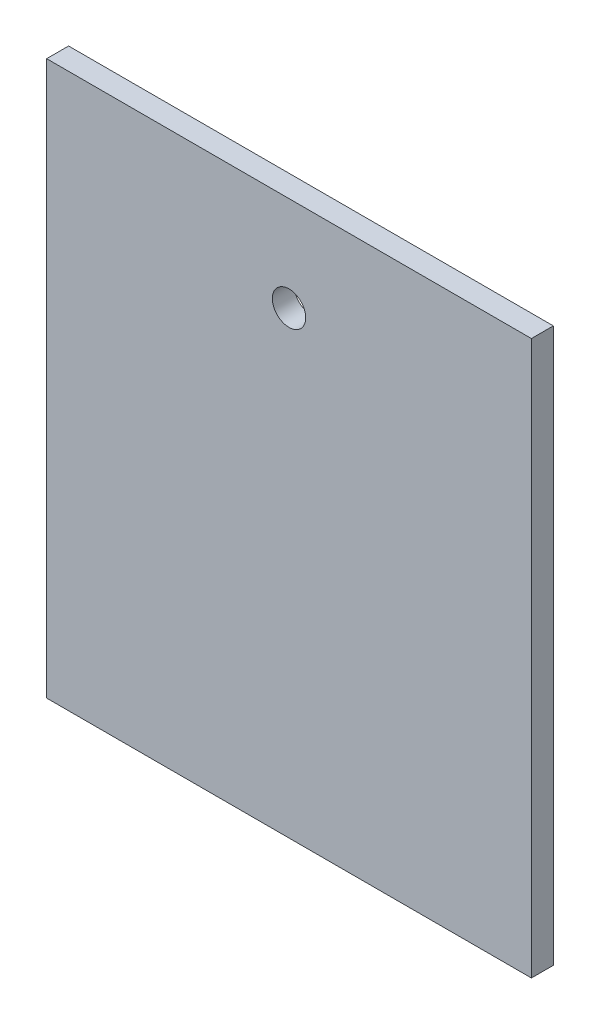
ISO-10303-21;
HEADER;
FILE_DESCRIPTION(('STEP AP214'),'2;1');
FILE_NAME('part.step','',(''),(''),'','','');
FILE_SCHEMA(('AUTOMOTIVE_DESIGN { 1 0 10303 214 1 1 1 1 }'));
ENDSEC;
DATA;
#1=APPLICATION_CONTEXT('core data for automotive mechanical design processes');
#2=APPLICATION_PROTOCOL_DEFINITION('international standard','automotive_design',2000,#1);
#3=PRODUCT_CONTEXT('',#1,'mechanical');
#4=PRODUCT('Part','Part','',(#3));
#5=PRODUCT_RELATED_PRODUCT_CATEGORY('part','',(#4));
#6=PRODUCT_DEFINITION_FORMATION('','',#4);
#7=PRODUCT_DEFINITION_CONTEXT('part definition',#1,'design');
#8=PRODUCT_DEFINITION('design','',#6,#7);
#9=PRODUCT_DEFINITION_SHAPE('','',#8);
#10=(LENGTH_UNIT() NAMED_UNIT(*) SI_UNIT(.MILLI.,.METRE.));
#11=(NAMED_UNIT(*) PLANE_ANGLE_UNIT() SI_UNIT($,.RADIAN.));
#12=(NAMED_UNIT(*) SI_UNIT($,.STERADIAN.) SOLID_ANGLE_UNIT());
#13=UNCERTAINTY_MEASURE_WITH_UNIT(LENGTH_MEASURE(1.E-05),#10,'distance_accuracy_value','');
#14=(GEOMETRIC_REPRESENTATION_CONTEXT(3) GLOBAL_UNCERTAINTY_ASSIGNED_CONTEXT((#13)) GLOBAL_UNIT_ASSIGNED_CONTEXT((#10,
#11,#12)) REPRESENTATION_CONTEXT('',''));
#15=CARTESIAN_POINT('',(0.,0.,0.));
#16=DIRECTION('',(0.,0.,1.));
#17=DIRECTION('',(1.,0.,0.));
#18=AXIS2_PLACEMENT_3D('',#15,#16,#17);
#19=CARTESIAN_POINT('',(0.,0.,3.175));
#20=DIRECTION('',(0.,0.,-1.));
#21=DIRECTION('',(-1.,0.,0.));
#22=AXIS2_PLACEMENT_3D('',#19,#20,#21);
#23=PLANE('',#22);
#24=DIRECTION('',(1.,0.,0.));
#25=VECTOR('',#24,1.);
#26=CARTESIAN_POINT('',(37.1356095053791,-0.0825578288975166,3.175));
#27=LINE('',#26,#25);
#28=CARTESIAN_POINT('',(-33.0335565021844,-0.0825578288975166,3.175));
#29=VERTEX_POINT('',#28);
#30=CARTESIAN_POINT('',(37.1356095053791,-0.0825578288975166,3.175));
#31=VERTEX_POINT('',#30);
#32=EDGE_CURVE('E86',#29,#31,#27,.T.);
#33=ORIENTED_EDGE('',*,*,#32,.T.);
#34=DIRECTION('',(0.,1.,0.));
#35=VECTOR('',#34,1.);
#36=CARTESIAN_POINT('',(37.1356095053791,80.0832933204729,3.175));
#37=LINE('',#36,#35);
#38=CARTESIAN_POINT('',(37.1356095053791,80.0832933204729,3.175));
#39=VERTEX_POINT('',#38);
#40=EDGE_CURVE('E81',#31,#39,#37,.T.);
#41=ORIENTED_EDGE('',*,*,#40,.T.);
#42=DIRECTION('',(-1.,0.,0.));
#43=VECTOR('',#42,1.);
#44=CARTESIAN_POINT('',(-33.0335565021844,80.0832933204729,3.175));
#45=LINE('',#44,#43);
#46=CARTESIAN_POINT('',(-33.0335565021844,80.0832933204729,3.175));
#47=VERTEX_POINT('',#46);
#48=EDGE_CURVE('E84',#39,#47,#45,.T.);
#49=ORIENTED_EDGE('',*,*,#48,.T.);
#50=DIRECTION('',(0.,-1.,0.));
#51=VECTOR('',#50,1.);
#52=CARTESIAN_POINT('',(-33.0335565021844,-0.0825578288975166,3.175));
#53=LINE('',#52,#51);
#54=EDGE_CURVE('E51',#47,#29,#53,.T.);
#55=ORIENTED_EDGE('',*,*,#54,.T.);
#56=EDGE_LOOP('',(#33,#41,#49,#55));
#57=FACE_BOUND('',#56,.T.);
#58=CARTESIAN_POINT('',(2.05020920502091,66.35,3.175));
#59=DIRECTION('',(0.,0.,1.));
#60=DIRECTION('',(1.,0.,0.));
#61=AXIS2_PLACEMENT_3D('',#58,#59,#60);
#62=CIRCLE('',#61,2.415);
#63=CARTESIAN_POINT('',(4.46520920502091,66.35,3.175));
#64=VERTEX_POINT('',#63);
#65=EDGE_CURVE('E101',#64,#64,#62,.T.);
#66=ORIENTED_EDGE('',*,*,#65,.F.);
#67=EDGE_LOOP('',(#66));
#68=FACE_BOUND('',#67,.T.);
#69=ADVANCED_FACE('F34',(#57,#68),#23,.F.);
#70=CARTESIAN_POINT('',(0.,0.,0.));
#71=DIRECTION('',(0.,0.,-1.));
#72=DIRECTION('',(-1.,0.,0.));
#73=AXIS2_PLACEMENT_3D('',#70,#71,#72);
#74=PLANE('',#73);
#75=DIRECTION('',(1.,0.,0.));
#76=VECTOR('',#75,1.);
#77=CARTESIAN_POINT('',(37.1356095053791,-0.0825578288975166,0.));
#78=LINE('',#77,#76);
#79=CARTESIAN_POINT('',(-33.0335565021844,-0.0825578288975166,0.));
#80=VERTEX_POINT('',#79);
#81=CARTESIAN_POINT('',(37.1356095053791,-0.0825578288975166,0.));
#82=VERTEX_POINT('',#81);
#83=EDGE_CURVE('E98',#80,#82,#78,.T.);
#84=ORIENTED_EDGE('',*,*,#83,.F.);
#85=DIRECTION('',(0.,-1.,0.));
#86=VECTOR('',#85,1.);
#87=CARTESIAN_POINT('',(-33.0335565021844,-0.0825578288975166,0.));
#88=LINE('',#87,#86);
#89=CARTESIAN_POINT('',(-33.0335565021844,80.0832933204729,0.));
#90=VERTEX_POINT('',#89);
#91=EDGE_CURVE('E74',#90,#80,#88,.T.);
#92=ORIENTED_EDGE('',*,*,#91,.F.);
#93=DIRECTION('',(-1.,0.,0.));
#94=VECTOR('',#93,1.);
#95=CARTESIAN_POINT('',(-33.0335565021844,80.0832933204729,0.));
#96=LINE('',#95,#94);
#97=CARTESIAN_POINT('',(37.1356095053791,80.0832933204729,0.));
#98=VERTEX_POINT('',#97);
#99=EDGE_CURVE('E68',#98,#90,#96,.T.);
#100=ORIENTED_EDGE('',*,*,#99,.F.);
#101=DIRECTION('',(0.,1.,0.));
#102=VECTOR('',#101,1.);
#103=CARTESIAN_POINT('',(37.1356095053791,80.0832933204729,0.));
#104=LINE('',#103,#102);
#105=EDGE_CURVE('E90',#82,#98,#104,.T.);
#106=ORIENTED_EDGE('',*,*,#105,.F.);
#107=EDGE_LOOP('',(#84,#92,#100,#106));
#108=FACE_BOUND('',#107,.T.);
#109=CARTESIAN_POINT('',(2.05020920502091,66.35,0.));
#110=DIRECTION('',(0.,0.,1.));
#111=DIRECTION('',(1.,0.,0.));
#112=AXIS2_PLACEMENT_3D('',#109,#110,#111);
#113=CIRCLE('',#112,2.415);
#114=CARTESIAN_POINT('',(4.46520920502091,66.35,0.));
#115=VERTEX_POINT('',#114);
#116=EDGE_CURVE('E113',#115,#115,#113,.T.);
#117=ORIENTED_EDGE('',*,*,#116,.T.);
#118=EDGE_LOOP('',(#117));
#119=FACE_BOUND('',#118,.T.);
#120=ADVANCED_FACE('F109',(#108,#119),#74,.T.);
#121=CARTESIAN_POINT('',(37.1356095053791,-0.0825578288975166,3.175));
#122=DIRECTION('',(0.,1.,0.));
#123=DIRECTION('',(0.,0.,1.));
#124=AXIS2_PLACEMENT_3D('',#121,#122,#123);
#125=PLANE('',#124);
#126=ORIENTED_EDGE('',*,*,#83,.T.);
#127=DIRECTION('',(0.,0.,-1.));
#128=VECTOR('',#127,1.);
#129=CARTESIAN_POINT('',(37.1356095053791,-0.0825578288975166,3.175));
#130=LINE('',#129,#128);
#131=EDGE_CURVE('E11',#31,#82,#130,.T.);
#132=ORIENTED_EDGE('',*,*,#131,.F.);
#133=ORIENTED_EDGE('',*,*,#32,.F.);
#134=DIRECTION('',(0.,0.,-1.));
#135=VECTOR('',#134,1.);
#136=CARTESIAN_POINT('',(-33.0335565021844,-0.0825578288975166,3.175));
#137=LINE('',#136,#135);
#138=EDGE_CURVE('E94',#29,#80,#137,.T.);
#139=ORIENTED_EDGE('',*,*,#138,.T.);
#140=EDGE_LOOP('',(#126,#132,#133,#139));
#141=FACE_BOUND('',#140,.T.);
#142=ADVANCED_FACE('F36',(#141),#125,.F.);
#143=CARTESIAN_POINT('',(37.1356095053791,80.0832933204729,3.175));
#144=DIRECTION('',(-1.,0.,0.));
#145=DIRECTION('',(0.,0.,1.));
#146=AXIS2_PLACEMENT_3D('',#143,#144,#145);
#147=PLANE('',#146);
#148=ORIENTED_EDGE('',*,*,#105,.T.);
#149=DIRECTION('',(0.,0.,-1.));
#150=VECTOR('',#149,1.);
#151=CARTESIAN_POINT('',(37.1356095053791,80.0832933204729,3.175));
#152=LINE('',#151,#150);
#153=EDGE_CURVE('E43',#39,#98,#152,.T.);
#154=ORIENTED_EDGE('',*,*,#153,.F.);
#155=ORIENTED_EDGE('',*,*,#40,.F.);
#156=ORIENTED_EDGE('',*,*,#131,.T.);
#157=EDGE_LOOP('',(#148,#154,#155,#156));
#158=FACE_BOUND('',#157,.T.);
#159=ADVANCED_FACE('F89',(#158),#147,.F.);
#160=CARTESIAN_POINT('',(-33.0335565021844,80.0832933204729,3.175));
#161=DIRECTION('',(0.,-1.,0.));
#162=DIRECTION('',(0.,0.,-1.));
#163=AXIS2_PLACEMENT_3D('',#160,#161,#162);
#164=PLANE('',#163);
#165=ORIENTED_EDGE('',*,*,#99,.T.);
#166=DIRECTION('',(0.,0.,-1.));
#167=VECTOR('',#166,1.);
#168=CARTESIAN_POINT('',(-33.0335565021844,80.0832933204729,3.175));
#169=LINE('',#168,#167);
#170=EDGE_CURVE('E91',#47,#90,#169,.T.);
#171=ORIENTED_EDGE('',*,*,#170,.F.);
#172=ORIENTED_EDGE('',*,*,#48,.F.);
#173=ORIENTED_EDGE('',*,*,#153,.T.);
#174=EDGE_LOOP('',(#165,#171,#172,#173));
#175=FACE_BOUND('',#174,.T.);
#176=ADVANCED_FACE('F92',(#175),#164,.F.);
#177=CARTESIAN_POINT('',(-33.0335565021844,-0.0825578288975166,3.175));
#178=DIRECTION('',(1.,0.,0.));
#179=DIRECTION('',(0.,0.,-1.));
#180=AXIS2_PLACEMENT_3D('',#177,#178,#179);
#181=PLANE('',#180);
#182=ORIENTED_EDGE('',*,*,#91,.T.);
#183=ORIENTED_EDGE('',*,*,#138,.F.);
#184=ORIENTED_EDGE('',*,*,#54,.F.);
#185=ORIENTED_EDGE('',*,*,#170,.T.);
#186=EDGE_LOOP('',(#182,#183,#184,#185));
#187=FACE_BOUND('',#186,.T.);
#188=ADVANCED_FACE('F106',(#187),#181,.F.);
#189=CARTESIAN_POINT('',(2.05020920502091,66.35,3.175));
#190=DIRECTION('',(0.,0.,-1.));
#191=DIRECTION('',(-1.,0.,0.));
#192=AXIS2_PLACEMENT_3D('',#189,#190,#191);
#193=CYLINDRICAL_SURFACE('',#192,2.415);
#194=ORIENTED_EDGE('',*,*,#65,.T.);
#195=EDGE_LOOP('',(#194));
#196=FACE_BOUND('',#195,.T.);
#197=ORIENTED_EDGE('',*,*,#116,.F.);
#198=EDGE_LOOP('',(#197));
#199=FACE_BOUND('',#198,.T.);
#200=ADVANCED_FACE('F119',(#196,#199),#193,.F.);
#201=CLOSED_SHELL('',(#69,#120,#142,#159,#176,#188,#200));
#202=MANIFOLD_SOLID_BREP('B2',#201);
#203=ADVANCED_BREP_SHAPE_REPRESENTATION('',(#18,#202),#14);
#204=SHAPE_DEFINITION_REPRESENTATION(#9,#203);
ENDSEC;
END-ISO-10303-21;
